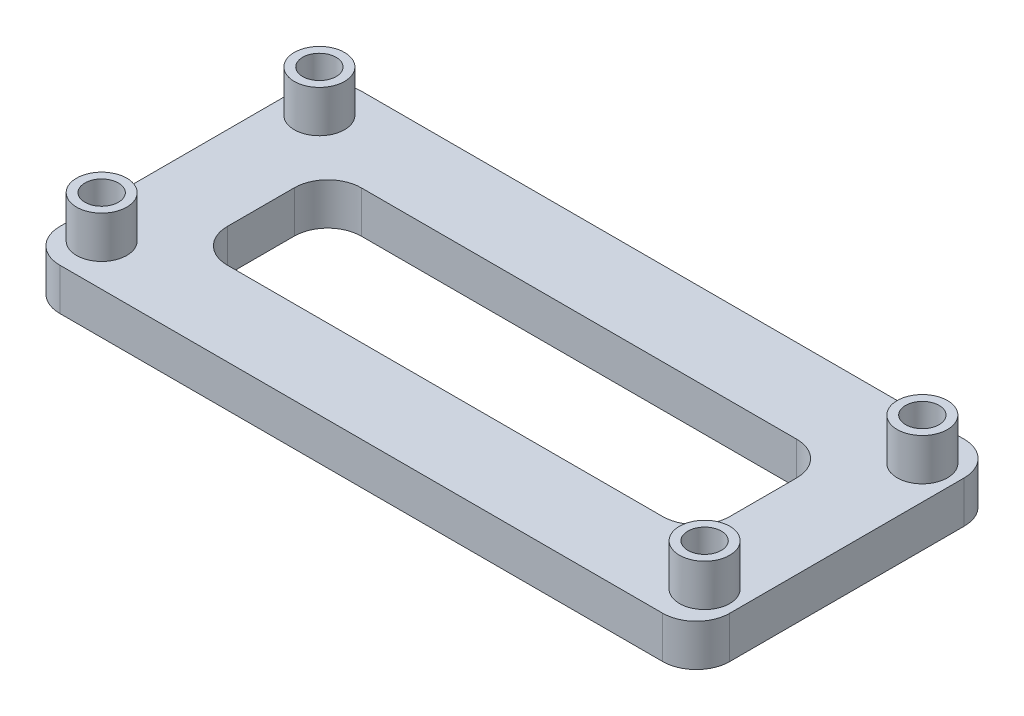
ISO-10303-21;
HEADER;
FILE_DESCRIPTION(('STEP AP214'),'2;1');
FILE_NAME('part.step','',(''),(''),'','','');
FILE_SCHEMA(('AUTOMOTIVE_DESIGN { 1 0 10303 214 1 1 1 1 }'));
ENDSEC;
DATA;
#1=APPLICATION_CONTEXT('core data for automotive mechanical design processes');
#2=APPLICATION_PROTOCOL_DEFINITION('international standard','automotive_design',2000,#1);
#3=PRODUCT_CONTEXT('',#1,'mechanical');
#4=PRODUCT('Part','Part','',(#3));
#5=PRODUCT_RELATED_PRODUCT_CATEGORY('part','',(#4));
#6=PRODUCT_DEFINITION_FORMATION('','',#4);
#7=PRODUCT_DEFINITION_CONTEXT('part definition',#1,'design');
#8=PRODUCT_DEFINITION('design','',#6,#7);
#9=PRODUCT_DEFINITION_SHAPE('','',#8);
#10=(LENGTH_UNIT() NAMED_UNIT(*) SI_UNIT(.MILLI.,.METRE.));
#11=(NAMED_UNIT(*) PLANE_ANGLE_UNIT() SI_UNIT($,.RADIAN.));
#12=(NAMED_UNIT(*) SI_UNIT($,.STERADIAN.) SOLID_ANGLE_UNIT());
#13=UNCERTAINTY_MEASURE_WITH_UNIT(LENGTH_MEASURE(1.E-05),#10,'distance_accuracy_value','');
#14=(GEOMETRIC_REPRESENTATION_CONTEXT(3) GLOBAL_UNCERTAINTY_ASSIGNED_CONTEXT((#13)) GLOBAL_UNIT_ASSIGNED_CONTEXT((#10,
#11,#12)) REPRESENTATION_CONTEXT('',''));
#15=CARTESIAN_POINT('',(0.,0.,0.));
#16=DIRECTION('',(0.,0.,1.));
#17=DIRECTION('',(1.,0.,0.));
#18=AXIS2_PLACEMENT_3D('',#15,#16,#17);
#19=CARTESIAN_POINT('',(0.,3.175,0.));
#20=DIRECTION('',(0.,-1.,0.));
#21=DIRECTION('',(0.,0.,-1.));
#22=AXIS2_PLACEMENT_3D('',#19,#20,#21);
#23=PLANE('',#22);
#24=CARTESIAN_POINT('',(48.26,3.175,-3.17499999999999));
#25=DIRECTION('',(0.,-1.,0.));
#26=DIRECTION('',(0.,0.,-1.));
#27=AXIS2_PLACEMENT_3D('',#24,#25,#26);
#28=CIRCLE('',#27,1.905);
#29=CARTESIAN_POINT('',(48.26,3.175,-5.07999999999999));
#30=VERTEX_POINT('',#29);
#31=EDGE_CURVE('E176',#30,#30,#28,.F.);
#32=ORIENTED_EDGE('',*,*,#31,.F.);
#33=EDGE_LOOP('',(#32));
#34=FACE_BOUND('',#33,.T.);
#35=CARTESIAN_POINT('',(2.54,3.175,-19.685));
#36=DIRECTION('',(0.,-1.,0.));
#37=DIRECTION('',(0.,0.,-1.));
#38=AXIS2_PLACEMENT_3D('',#35,#36,#37);
#39=CIRCLE('',#38,1.905);
#40=CARTESIAN_POINT('',(2.54,3.175,-21.59));
#41=VERTEX_POINT('',#40);
#42=EDGE_CURVE('E290',#41,#41,#39,.F.);
#43=ORIENTED_EDGE('',*,*,#42,.F.);
#44=EDGE_LOOP('',(#43));
#45=FACE_BOUND('',#44,.T.);
#46=DIRECTION('',(1.,0.,0.));
#47=VECTOR('',#46,1.);
#48=CARTESIAN_POINT('',(0.,3.175,0.));
#49=LINE('',#48,#47);
#50=CARTESIAN_POINT('',(2.54,3.175,0.));
#51=VERTEX_POINT('',#50);
#52=CARTESIAN_POINT('',(48.26,3.175,0.));
#53=VERTEX_POINT('',#52);
#54=EDGE_CURVE('E282',#51,#53,#49,.T.);
#55=ORIENTED_EDGE('',*,*,#54,.T.);
#56=CARTESIAN_POINT('',(48.26,3.175,-2.54));
#57=DIRECTION('',(0.,-1.,0.));
#58=DIRECTION('',(0.,0.,-1.));
#59=AXIS2_PLACEMENT_3D('',#56,#57,#58);
#60=CIRCLE('',#59,2.54);
#61=CARTESIAN_POINT('',(50.8,3.175,-2.54));
#62=VERTEX_POINT('',#61);
#63=EDGE_CURVE('E216',#53,#62,#60,.F.);
#64=ORIENTED_EDGE('',*,*,#63,.T.);
#65=DIRECTION('',(0.,0.,-1.));
#66=VECTOR('',#65,1.);
#67=CARTESIAN_POINT('',(50.8,3.175,0.));
#68=LINE('',#67,#66);
#69=CARTESIAN_POINT('',(50.8,3.175,-20.32));
#70=VERTEX_POINT('',#69);
#71=EDGE_CURVE('E286',#62,#70,#68,.T.);
#72=ORIENTED_EDGE('',*,*,#71,.T.);
#73=CARTESIAN_POINT('',(48.26,3.175,-20.32));
#74=DIRECTION('',(0.,-1.,0.));
#75=DIRECTION('',(0.,0.,-1.));
#76=AXIS2_PLACEMENT_3D('',#73,#74,#75);
#77=CIRCLE('',#76,2.54);
#78=CARTESIAN_POINT('',(48.26,3.175,-22.86));
#79=VERTEX_POINT('',#78);
#80=EDGE_CURVE('E55',#70,#79,#77,.F.);
#81=ORIENTED_EDGE('',*,*,#80,.T.);
#82=DIRECTION('',(-1.,0.,0.));
#83=VECTOR('',#82,1.);
#84=CARTESIAN_POINT('',(0.,3.175,-22.86));
#85=LINE('',#84,#83);
#86=CARTESIAN_POINT('',(2.54,3.175,-22.86));
#87=VERTEX_POINT('',#86);
#88=EDGE_CURVE('E288',#79,#87,#85,.T.);
#89=ORIENTED_EDGE('',*,*,#88,.T.);
#90=CARTESIAN_POINT('',(2.54,3.175,-20.32));
#91=DIRECTION('',(0.,-1.,0.));
#92=DIRECTION('',(0.,0.,-1.));
#93=AXIS2_PLACEMENT_3D('',#90,#91,#92);
#94=CIRCLE('',#93,2.54);
#95=CARTESIAN_POINT('',(0.,3.175,-20.32));
#96=VERTEX_POINT('',#95);
#97=EDGE_CURVE('E213',#87,#96,#94,.F.);
#98=ORIENTED_EDGE('',*,*,#97,.T.);
#99=DIRECTION('',(0.,0.,1.));
#100=VECTOR('',#99,1.);
#101=CARTESIAN_POINT('',(0.,3.175,0.));
#102=LINE('',#101,#100);
#103=CARTESIAN_POINT('',(0.,3.175,-2.54));
#104=VERTEX_POINT('',#103);
#105=EDGE_CURVE('E279',#96,#104,#102,.T.);
#106=ORIENTED_EDGE('',*,*,#105,.T.);
#107=CARTESIAN_POINT('',(2.54,3.175,-2.54));
#108=DIRECTION('',(0.,-1.,0.));
#109=DIRECTION('',(0.,0.,-1.));
#110=AXIS2_PLACEMENT_3D('',#107,#108,#109);
#111=CIRCLE('',#110,2.54);
#112=EDGE_CURVE('E211',#104,#51,#111,.F.);
#113=ORIENTED_EDGE('',*,*,#112,.T.);
#114=EDGE_LOOP('',(#55,#64,#72,#81,#89,#98,#106,#113));
#115=FACE_BOUND('',#114,.T.);
#116=DIRECTION('',(0.,0.,1.));
#117=VECTOR('',#116,1.);
#118=CARTESIAN_POINT('',(6.35,3.175,-16.51));
#119=LINE('',#118,#117);
#120=CARTESIAN_POINT('',(6.35,3.175,-13.97));
#121=VERTEX_POINT('',#120);
#122=CARTESIAN_POINT('',(6.35,3.175,-8.89));
#123=VERTEX_POINT('',#122);
#124=EDGE_CURVE('E260',#121,#123,#119,.T.);
#125=ORIENTED_EDGE('',*,*,#124,.F.);
#126=CARTESIAN_POINT('',(8.89,3.175,-13.97));
#127=DIRECTION('',(0.,-1.,0.));
#128=DIRECTION('',(0.,0.,-1.));
#129=AXIS2_PLACEMENT_3D('',#126,#127,#128);
#130=CIRCLE('',#129,2.54);
#131=CARTESIAN_POINT('',(8.89,3.175,-16.51));
#132=VERTEX_POINT('',#131);
#133=EDGE_CURVE('E11',#121,#132,#130,.T.);
#134=ORIENTED_EDGE('',*,*,#133,.T.);
#135=DIRECTION('',(-1.,0.,0.));
#136=VECTOR('',#135,1.);
#137=CARTESIAN_POINT('',(6.35,3.175,-16.51));
#138=LINE('',#137,#136);
#139=CARTESIAN_POINT('',(41.91,3.175,-16.51));
#140=VERTEX_POINT('',#139);
#141=EDGE_CURVE('E246',#140,#132,#138,.T.);
#142=ORIENTED_EDGE('',*,*,#141,.F.);
#143=CARTESIAN_POINT('',(41.91,3.175,-13.97));
#144=DIRECTION('',(0.,-1.,0.));
#145=DIRECTION('',(0.,0.,-1.));
#146=AXIS2_PLACEMENT_3D('',#143,#144,#145);
#147=CIRCLE('',#146,2.54);
#148=CARTESIAN_POINT('',(44.45,3.175,-13.97));
#149=VERTEX_POINT('',#148);
#150=EDGE_CURVE('E157',#140,#149,#147,.T.);
#151=ORIENTED_EDGE('',*,*,#150,.T.);
#152=DIRECTION('',(0.,0.,-1.));
#153=VECTOR('',#152,1.);
#154=CARTESIAN_POINT('',(44.45,3.175,-16.51));
#155=LINE('',#154,#153);
#156=CARTESIAN_POINT('',(44.45,3.175,-8.89));
#157=VERTEX_POINT('',#156);
#158=EDGE_CURVE('E243',#157,#149,#155,.T.);
#159=ORIENTED_EDGE('',*,*,#158,.F.);
#160=CARTESIAN_POINT('',(41.91,3.175,-8.89));
#161=DIRECTION('',(0.,-1.,0.));
#162=DIRECTION('',(0.,0.,-1.));
#163=AXIS2_PLACEMENT_3D('',#160,#161,#162);
#164=CIRCLE('',#163,2.54);
#165=CARTESIAN_POINT('',(41.91,3.175,-6.35));
#166=VERTEX_POINT('',#165);
#167=EDGE_CURVE('E233',#157,#166,#164,.T.);
#168=ORIENTED_EDGE('',*,*,#167,.T.);
#169=DIRECTION('',(1.,0.,0.));
#170=VECTOR('',#169,1.);
#171=CARTESIAN_POINT('',(6.35,3.175,-6.35));
#172=LINE('',#171,#170);
#173=CARTESIAN_POINT('',(8.89,3.175,-6.35));
#174=VERTEX_POINT('',#173);
#175=EDGE_CURVE('E254',#174,#166,#172,.T.);
#176=ORIENTED_EDGE('',*,*,#175,.F.);
#177=CARTESIAN_POINT('',(8.89,3.175,-8.89));
#178=DIRECTION('',(0.,-1.,0.));
#179=DIRECTION('',(0.,0.,-1.));
#180=AXIS2_PLACEMENT_3D('',#177,#178,#179);
#181=CIRCLE('',#180,2.54);
#182=EDGE_CURVE('E229',#174,#123,#181,.T.);
#183=ORIENTED_EDGE('',*,*,#182,.T.);
#184=EDGE_LOOP('',(#125,#134,#142,#151,#159,#168,#176,#183));
#185=FACE_BOUND('',#184,.T.);
#186=CARTESIAN_POINT('',(2.54,3.175,-3.175));
#187=DIRECTION('',(0.,-1.,0.));
#188=DIRECTION('',(0.,0.,-1.));
#189=AXIS2_PLACEMENT_3D('',#186,#187,#188);
#190=CIRCLE('',#189,1.905);
#191=CARTESIAN_POINT('',(2.54,3.175,-5.08));
#192=VERTEX_POINT('',#191);
#193=EDGE_CURVE('E302',#192,#192,#190,.F.);
#194=ORIENTED_EDGE('',*,*,#193,.F.);
#195=EDGE_LOOP('',(#194));
#196=FACE_BOUND('',#195,.T.);
#197=CARTESIAN_POINT('',(48.26,3.175,-19.685));
#198=DIRECTION('',(0.,-1.,0.));
#199=DIRECTION('',(0.,0.,-1.));
#200=AXIS2_PLACEMENT_3D('',#197,#198,#199);
#201=CIRCLE('',#200,1.905);
#202=CARTESIAN_POINT('',(48.26,3.175,-21.59));
#203=VERTEX_POINT('',#202);
#204=EDGE_CURVE('E171',#203,#203,#201,.F.);
#205=ORIENTED_EDGE('',*,*,#204,.F.);
#206=EDGE_LOOP('',(#205));
#207=FACE_BOUND('',#206,.T.);
#208=ADVANCED_FACE('F33',(#34,#45,#115,#185,#196,#207),#23,.F.);
#209=CARTESIAN_POINT('',(0.,0.,0.));
#210=DIRECTION('',(0.,-1.,0.));
#211=DIRECTION('',(0.,0.,-1.));
#212=AXIS2_PLACEMENT_3D('',#209,#210,#211);
#213=PLANE('',#212);
#214=CARTESIAN_POINT('',(48.26,0.,-3.175));
#215=DIRECTION('',(0.,1.,0.));
#216=DIRECTION('',(0.,0.,1.));
#217=AXIS2_PLACEMENT_3D('',#214,#215,#216);
#218=CIRCLE('',#217,1.27);
#219=CARTESIAN_POINT('',(48.26,0.,-1.905));
#220=VERTEX_POINT('',#219);
#221=EDGE_CURVE('E266',#220,#220,#218,.T.);
#222=ORIENTED_EDGE('',*,*,#221,.T.);
#223=EDGE_LOOP('',(#222));
#224=FACE_BOUND('',#223,.T.);
#225=CARTESIAN_POINT('',(48.26,0.,-19.685));
#226=DIRECTION('',(0.,1.,0.));
#227=DIRECTION('',(0.,0.,1.));
#228=AXIS2_PLACEMENT_3D('',#225,#226,#227);
#229=CIRCLE('',#228,1.27);
#230=CARTESIAN_POINT('',(48.26,0.,-18.415));
#231=VERTEX_POINT('',#230);
#232=EDGE_CURVE('E272',#231,#231,#229,.T.);
#233=ORIENTED_EDGE('',*,*,#232,.T.);
#234=EDGE_LOOP('',(#233));
#235=FACE_BOUND('',#234,.T.);
#236=DIRECTION('',(0.,0.,-1.));
#237=VECTOR('',#236,1.);
#238=CARTESIAN_POINT('',(50.8,0.,0.));
#239=LINE('',#238,#237);
#240=CARTESIAN_POINT('',(50.8,0.,-2.54));
#241=VERTEX_POINT('',#240);
#242=CARTESIAN_POINT('',(50.8,0.,-20.32));
#243=VERTEX_POINT('',#242);
#244=EDGE_CURVE('E296',#241,#243,#239,.T.);
#245=ORIENTED_EDGE('',*,*,#244,.F.);
#246=CARTESIAN_POINT('',(48.26,0.,-2.54));
#247=DIRECTION('',(0.,-1.,0.));
#248=DIRECTION('',(0.,0.,-1.));
#249=AXIS2_PLACEMENT_3D('',#246,#247,#248);
#250=CIRCLE('',#249,2.54);
#251=CARTESIAN_POINT('',(48.26,0.,0.));
#252=VERTEX_POINT('',#251);
#253=EDGE_CURVE('E204',#241,#252,#250,.T.);
#254=ORIENTED_EDGE('',*,*,#253,.T.);
#255=DIRECTION('',(1.,0.,0.));
#256=VECTOR('',#255,1.);
#257=CARTESIAN_POINT('',(0.,0.,0.));
#258=LINE('',#257,#256);
#259=CARTESIAN_POINT('',(2.54,0.,0.));
#260=VERTEX_POINT('',#259);
#261=EDGE_CURVE('E293',#260,#252,#258,.T.);
#262=ORIENTED_EDGE('',*,*,#261,.F.);
#263=CARTESIAN_POINT('',(2.54,0.,-2.54));
#264=DIRECTION('',(0.,-1.,0.));
#265=DIRECTION('',(0.,0.,-1.));
#266=AXIS2_PLACEMENT_3D('',#263,#264,#265);
#267=CIRCLE('',#266,2.54);
#268=CARTESIAN_POINT('',(0.,0.,-2.54));
#269=VERTEX_POINT('',#268);
#270=EDGE_CURVE('E198',#260,#269,#267,.T.);
#271=ORIENTED_EDGE('',*,*,#270,.T.);
#272=DIRECTION('',(0.,0.,1.));
#273=VECTOR('',#272,1.);
#274=CARTESIAN_POINT('',(0.,0.,0.));
#275=LINE('',#274,#273);
#276=CARTESIAN_POINT('',(0.,0.,-20.32));
#277=VERTEX_POINT('',#276);
#278=EDGE_CURVE('E278',#277,#269,#275,.T.);
#279=ORIENTED_EDGE('',*,*,#278,.F.);
#280=CARTESIAN_POINT('',(2.54,0.,-20.32));
#281=DIRECTION('',(0.,-1.,0.));
#282=DIRECTION('',(0.,0.,-1.));
#283=AXIS2_PLACEMENT_3D('',#280,#281,#282);
#284=CIRCLE('',#283,2.54);
#285=CARTESIAN_POINT('',(2.54,0.,-22.86));
#286=VERTEX_POINT('',#285);
#287=EDGE_CURVE('E200',#277,#286,#284,.T.);
#288=ORIENTED_EDGE('',*,*,#287,.T.);
#289=DIRECTION('',(-1.,0.,0.));
#290=VECTOR('',#289,1.);
#291=CARTESIAN_POINT('',(0.,0.,-22.86));
#292=LINE('',#291,#290);
#293=CARTESIAN_POINT('',(48.26,0.,-22.86));
#294=VERTEX_POINT('',#293);
#295=EDGE_CURVE('E283',#294,#286,#292,.T.);
#296=ORIENTED_EDGE('',*,*,#295,.F.);
#297=CARTESIAN_POINT('',(48.26,0.,-20.32));
#298=DIRECTION('',(0.,-1.,0.));
#299=DIRECTION('',(0.,0.,-1.));
#300=AXIS2_PLACEMENT_3D('',#297,#298,#299);
#301=CIRCLE('',#300,2.54);
#302=EDGE_CURVE('E202',#294,#243,#301,.T.);
#303=ORIENTED_EDGE('',*,*,#302,.T.);
#304=EDGE_LOOP('',(#245,#254,#262,#271,#279,#288,#296,#303));
#305=FACE_BOUND('',#304,.T.);
#306=CARTESIAN_POINT('',(2.54,0.,-19.685));
#307=DIRECTION('',(0.,1.,0.));
#308=DIRECTION('',(0.,0.,1.));
#309=AXIS2_PLACEMENT_3D('',#306,#307,#308);
#310=CIRCLE('',#309,1.27);
#311=CARTESIAN_POINT('',(2.54,0.,-18.415));
#312=VERTEX_POINT('',#311);
#313=EDGE_CURVE('E275',#312,#312,#310,.T.);
#314=ORIENTED_EDGE('',*,*,#313,.T.);
#315=EDGE_LOOP('',(#314));
#316=FACE_BOUND('',#315,.T.);
#317=CARTESIAN_POINT('',(2.54,0.,-3.175));
#318=DIRECTION('',(0.,1.,0.));
#319=DIRECTION('',(0.,0.,1.));
#320=AXIS2_PLACEMENT_3D('',#317,#318,#319);
#321=CIRCLE('',#320,1.27);
#322=CARTESIAN_POINT('',(2.54,0.,-1.905));
#323=VERTEX_POINT('',#322);
#324=EDGE_CURVE('E269',#323,#323,#321,.T.);
#325=ORIENTED_EDGE('',*,*,#324,.T.);
#326=EDGE_LOOP('',(#325));
#327=FACE_BOUND('',#326,.T.);
#328=DIRECTION('',(0.,0.,-1.));
#329=VECTOR('',#328,1.);
#330=CARTESIAN_POINT('',(44.45,0.,-16.51));
#331=LINE('',#330,#329);
#332=CARTESIAN_POINT('',(44.45,0.,-8.89));
#333=VERTEX_POINT('',#332);
#334=CARTESIAN_POINT('',(44.45,0.,-13.97));
#335=VERTEX_POINT('',#334);
#336=EDGE_CURVE('E257',#333,#335,#331,.T.);
#337=ORIENTED_EDGE('',*,*,#336,.T.);
#338=CARTESIAN_POINT('',(41.91,0.,-13.97));
#339=DIRECTION('',(0.,-1.,0.));
#340=DIRECTION('',(0.,0.,-1.));
#341=AXIS2_PLACEMENT_3D('',#338,#339,#340);
#342=CIRCLE('',#341,2.54);
#343=CARTESIAN_POINT('',(41.91,0.,-16.51));
#344=VERTEX_POINT('',#343);
#345=EDGE_CURVE('E235',#335,#344,#342,.F.);
#346=ORIENTED_EDGE('',*,*,#345,.T.);
#347=DIRECTION('',(-1.,0.,0.));
#348=VECTOR('',#347,1.);
#349=CARTESIAN_POINT('',(6.35,0.,-16.51));
#350=LINE('',#349,#348);
#351=CARTESIAN_POINT('',(8.89,0.,-16.51));
#352=VERTEX_POINT('',#351);
#353=EDGE_CURVE('E152',#344,#352,#350,.T.);
#354=ORIENTED_EDGE('',*,*,#353,.T.);
#355=CARTESIAN_POINT('',(8.89,0.,-13.97));
#356=DIRECTION('',(0.,-1.,0.));
#357=DIRECTION('',(0.,0.,-1.));
#358=AXIS2_PLACEMENT_3D('',#355,#356,#357);
#359=CIRCLE('',#358,2.54);
#360=CARTESIAN_POINT('',(6.35,0.,-13.97));
#361=VERTEX_POINT('',#360);
#362=EDGE_CURVE('E41',#352,#361,#359,.F.);
#363=ORIENTED_EDGE('',*,*,#362,.T.);
#364=DIRECTION('',(0.,0.,1.));
#365=VECTOR('',#364,1.);
#366=CARTESIAN_POINT('',(6.35,0.,-16.51));
#367=LINE('',#366,#365);
#368=CARTESIAN_POINT('',(6.35,0.,-8.89));
#369=VERTEX_POINT('',#368);
#370=EDGE_CURVE('E150',#361,#369,#367,.T.);
#371=ORIENTED_EDGE('',*,*,#370,.T.);
#372=CARTESIAN_POINT('',(8.89,0.,-8.89));
#373=DIRECTION('',(0.,-1.,0.));
#374=DIRECTION('',(0.,0.,-1.));
#375=AXIS2_PLACEMENT_3D('',#372,#373,#374);
#376=CIRCLE('',#375,2.54);
#377=CARTESIAN_POINT('',(8.89,0.,-6.35));
#378=VERTEX_POINT('',#377);
#379=EDGE_CURVE('E227',#369,#378,#376,.F.);
#380=ORIENTED_EDGE('',*,*,#379,.T.);
#381=DIRECTION('',(1.,0.,0.));
#382=VECTOR('',#381,1.);
#383=CARTESIAN_POINT('',(6.35,0.,-6.35));
#384=LINE('',#383,#382);
#385=CARTESIAN_POINT('',(41.91,0.,-6.35));
#386=VERTEX_POINT('',#385);
#387=EDGE_CURVE('E166',#378,#386,#384,.T.);
#388=ORIENTED_EDGE('',*,*,#387,.T.);
#389=CARTESIAN_POINT('',(41.91,0.,-8.89));
#390=DIRECTION('',(0.,-1.,0.));
#391=DIRECTION('',(0.,0.,-1.));
#392=AXIS2_PLACEMENT_3D('',#389,#390,#391);
#393=CIRCLE('',#392,2.54);
#394=EDGE_CURVE('E231',#386,#333,#393,.F.);
#395=ORIENTED_EDGE('',*,*,#394,.T.);
#396=EDGE_LOOP('',(#337,#346,#354,#363,#371,#380,#388,#395));
#397=FACE_BOUND('',#396,.T.);
#398=ADVANCED_FACE('F149',(#224,#235,#305,#316,#327,#397),#213,.T.);
#399=CARTESIAN_POINT('',(0.,3.175,0.));
#400=DIRECTION('',(1.,0.,0.));
#401=DIRECTION('',(0.,0.,-1.));
#402=AXIS2_PLACEMENT_3D('',#399,#400,#401);
#403=PLANE('',#402);
#404=ORIENTED_EDGE('',*,*,#105,.F.);
#405=DIRECTION('',(0.,-1.,0.));
#406=VECTOR('',#405,1.);
#407=CARTESIAN_POINT('',(0.,3.175,-20.32));
#408=LINE('',#407,#406);
#409=EDGE_CURVE('E224',#96,#277,#408,.T.);
#410=ORIENTED_EDGE('',*,*,#409,.T.);
#411=ORIENTED_EDGE('',*,*,#278,.T.);
#412=DIRECTION('',(0.,-1.,0.));
#413=VECTOR('',#412,1.);
#414=CARTESIAN_POINT('',(0.,3.175,-2.54));
#415=LINE('',#414,#413);
#416=EDGE_CURVE('E222',#269,#104,#415,.F.);
#417=ORIENTED_EDGE('',*,*,#416,.T.);
#418=EDGE_LOOP('',(#404,#410,#411,#417));
#419=FACE_BOUND('',#418,.T.);
#420=ADVANCED_FACE('F342',(#419),#403,.F.);
#421=CARTESIAN_POINT('',(0.,3.175,0.));
#422=DIRECTION('',(0.,0.,-1.));
#423=DIRECTION('',(-1.,0.,0.));
#424=AXIS2_PLACEMENT_3D('',#421,#422,#423);
#425=PLANE('',#424);
#426=ORIENTED_EDGE('',*,*,#261,.T.);
#427=DIRECTION('',(0.,-1.,0.));
#428=VECTOR('',#427,1.);
#429=CARTESIAN_POINT('',(48.26,3.175,0.));
#430=LINE('',#429,#428);
#431=EDGE_CURVE('E209',#252,#53,#430,.F.);
#432=ORIENTED_EDGE('',*,*,#431,.T.);
#433=ORIENTED_EDGE('',*,*,#54,.F.);
#434=DIRECTION('',(0.,-1.,0.));
#435=VECTOR('',#434,1.);
#436=CARTESIAN_POINT('',(2.54,3.175,0.));
#437=LINE('',#436,#435);
#438=EDGE_CURVE('E206',#51,#260,#437,.T.);
#439=ORIENTED_EDGE('',*,*,#438,.T.);
#440=EDGE_LOOP('',(#426,#432,#433,#439));
#441=FACE_BOUND('',#440,.T.);
#442=ADVANCED_FACE('F345',(#441),#425,.F.);
#443=CARTESIAN_POINT('',(50.8,3.175,0.));
#444=DIRECTION('',(-1.,0.,0.));
#445=DIRECTION('',(0.,0.,1.));
#446=AXIS2_PLACEMENT_3D('',#443,#444,#445);
#447=PLANE('',#446);
#448=ORIENTED_EDGE('',*,*,#71,.F.);
#449=DIRECTION('',(0.,-1.,0.));
#450=VECTOR('',#449,1.);
#451=CARTESIAN_POINT('',(50.8,3.175,-2.54));
#452=LINE('',#451,#450);
#453=EDGE_CURVE('E195',#62,#241,#452,.T.);
#454=ORIENTED_EDGE('',*,*,#453,.T.);
#455=ORIENTED_EDGE('',*,*,#244,.T.);
#456=DIRECTION('',(0.,-1.,0.));
#457=VECTOR('',#456,1.);
#458=CARTESIAN_POINT('',(50.8,3.175,-20.32));
#459=LINE('',#458,#457);
#460=EDGE_CURVE('E193',#243,#70,#459,.F.);
#461=ORIENTED_EDGE('',*,*,#460,.T.);
#462=EDGE_LOOP('',(#448,#454,#455,#461));
#463=FACE_BOUND('',#462,.T.);
#464=ADVANCED_FACE('F325',(#463),#447,.F.);
#465=CARTESIAN_POINT('',(0.,3.175,-22.86));
#466=DIRECTION('',(0.,0.,1.));
#467=DIRECTION('',(1.,0.,0.));
#468=AXIS2_PLACEMENT_3D('',#465,#466,#467);
#469=PLANE('',#468);
#470=ORIENTED_EDGE('',*,*,#88,.F.);
#471=DIRECTION('',(0.,-1.,0.));
#472=VECTOR('',#471,1.);
#473=CARTESIAN_POINT('',(48.26,3.175,-22.86));
#474=LINE('',#473,#472);
#475=EDGE_CURVE('E219',#79,#294,#474,.T.);
#476=ORIENTED_EDGE('',*,*,#475,.T.);
#477=ORIENTED_EDGE('',*,*,#295,.T.);
#478=DIRECTION('',(0.,-1.,0.));
#479=VECTOR('',#478,1.);
#480=CARTESIAN_POINT('',(2.54,3.175,-22.86));
#481=LINE('',#480,#479);
#482=EDGE_CURVE('E48',#286,#87,#481,.F.);
#483=ORIENTED_EDGE('',*,*,#482,.T.);
#484=EDGE_LOOP('',(#470,#476,#477,#483));
#485=FACE_BOUND('',#484,.T.);
#486=ADVANCED_FACE('F334',(#485),#469,.F.);
#487=CARTESIAN_POINT('',(2.54,3.175,-19.685));
#488=DIRECTION('',(0.,-1.,0.));
#489=DIRECTION('',(0.,0.,-1.));
#490=AXIS2_PLACEMENT_3D('',#487,#488,#489);
#491=CYLINDRICAL_SURFACE('',#490,1.27);
#492=ORIENTED_EDGE('',*,*,#313,.F.);
#493=EDGE_LOOP('',(#492));
#494=FACE_BOUND('',#493,.T.);
#495=CARTESIAN_POINT('',(2.54,6.35,-19.685));
#496=DIRECTION('',(0.,1.,0.));
#497=DIRECTION('',(0.,0.,1.));
#498=AXIS2_PLACEMENT_3D('',#495,#496,#497);
#499=CIRCLE('',#498,1.27);
#500=CARTESIAN_POINT('',(2.54,6.35,-18.415));
#501=VERTEX_POINT('',#500);
#502=EDGE_CURVE('E628',#501,#501,#499,.T.);
#503=ORIENTED_EDGE('',*,*,#502,.T.);
#504=EDGE_LOOP('',(#503));
#505=FACE_BOUND('',#504,.T.);
#506=ADVANCED_FACE('F469',(#494,#505),#491,.F.);
#507=CARTESIAN_POINT('',(48.26,3.175,-19.685));
#508=DIRECTION('',(0.,-1.,0.));
#509=DIRECTION('',(0.,0.,-1.));
#510=AXIS2_PLACEMENT_3D('',#507,#508,#509);
#511=CYLINDRICAL_SURFACE('',#510,1.27);
#512=ORIENTED_EDGE('',*,*,#232,.F.);
#513=EDGE_LOOP('',(#512));
#514=FACE_BOUND('',#513,.T.);
#515=CARTESIAN_POINT('',(48.26,6.35,-19.685));
#516=DIRECTION('',(0.,1.,0.));
#517=DIRECTION('',(0.,0.,-1.));
#518=AXIS2_PLACEMENT_3D('',#515,#516,#517);
#519=CIRCLE('',#518,1.27);
#520=CARTESIAN_POINT('',(48.26,6.35,-20.955));
#521=VERTEX_POINT('',#520);
#522=EDGE_CURVE('E658',#521,#521,#519,.T.);
#523=ORIENTED_EDGE('',*,*,#522,.T.);
#524=EDGE_LOOP('',(#523));
#525=FACE_BOUND('',#524,.T.);
#526=ADVANCED_FACE('F593',(#514,#525),#511,.F.);
#527=CARTESIAN_POINT('',(2.54,3.175,-3.175));
#528=DIRECTION('',(0.,-1.,0.));
#529=DIRECTION('',(0.,0.,-1.));
#530=AXIS2_PLACEMENT_3D('',#527,#528,#529);
#531=CYLINDRICAL_SURFACE('',#530,1.27);
#532=ORIENTED_EDGE('',*,*,#324,.F.);
#533=EDGE_LOOP('',(#532));
#534=FACE_BOUND('',#533,.T.);
#535=CARTESIAN_POINT('',(2.54,6.35,-3.175));
#536=DIRECTION('',(0.,1.,0.));
#537=DIRECTION('',(0.,0.,-1.));
#538=AXIS2_PLACEMENT_3D('',#535,#536,#537);
#539=CIRCLE('',#538,1.27);
#540=CARTESIAN_POINT('',(2.54,6.35,-4.445));
#541=VERTEX_POINT('',#540);
#542=EDGE_CURVE('E635',#541,#541,#539,.T.);
#543=ORIENTED_EDGE('',*,*,#542,.T.);
#544=EDGE_LOOP('',(#543));
#545=FACE_BOUND('',#544,.T.);
#546=ADVANCED_FACE('F583',(#534,#545),#531,.F.);
#547=CARTESIAN_POINT('',(48.26,3.175,-3.175));
#548=DIRECTION('',(0.,-1.,0.));
#549=DIRECTION('',(0.,0.,-1.));
#550=AXIS2_PLACEMENT_3D('',#547,#548,#549);
#551=CYLINDRICAL_SURFACE('',#550,1.27);
#552=ORIENTED_EDGE('',*,*,#221,.F.);
#553=EDGE_LOOP('',(#552));
#554=FACE_BOUND('',#553,.T.);
#555=CARTESIAN_POINT('',(48.26,6.35,-3.17499999999999));
#556=DIRECTION('',(0.,1.,0.));
#557=DIRECTION('',(0.,0.,1.));
#558=AXIS2_PLACEMENT_3D('',#555,#556,#557);
#559=CIRCLE('',#558,1.27);
#560=CARTESIAN_POINT('',(48.26,6.35,-1.90499999999999));
#561=VERTEX_POINT('',#560);
#562=EDGE_CURVE('E652',#561,#561,#559,.T.);
#563=ORIENTED_EDGE('',*,*,#562,.T.);
#564=EDGE_LOOP('',(#563));
#565=FACE_BOUND('',#564,.T.);
#566=ADVANCED_FACE('F458',(#554,#565),#551,.F.);
#567=CARTESIAN_POINT('',(6.35,3.175,-16.51));
#568=DIRECTION('',(1.,0.,0.));
#569=DIRECTION('',(0.,0.,-1.));
#570=AXIS2_PLACEMENT_3D('',#567,#568,#569);
#571=PLANE('',#570);
#572=ORIENTED_EDGE('',*,*,#124,.T.);
#573=DIRECTION('',(0.,-1.,0.));
#574=VECTOR('',#573,1.);
#575=CARTESIAN_POINT('',(6.35,0.,-8.89));
#576=LINE('',#575,#574);
#577=EDGE_CURVE('E165',#123,#369,#576,.T.);
#578=ORIENTED_EDGE('',*,*,#577,.T.);
#579=ORIENTED_EDGE('',*,*,#370,.F.);
#580=DIRECTION('',(0.,-1.,0.));
#581=VECTOR('',#580,1.);
#582=CARTESIAN_POINT('',(6.35,3.175,-13.97));
#583=LINE('',#582,#581);
#584=EDGE_CURVE('E162',#361,#121,#583,.F.);
#585=ORIENTED_EDGE('',*,*,#584,.T.);
#586=EDGE_LOOP('',(#572,#578,#579,#585));
#587=FACE_BOUND('',#586,.T.);
#588=ADVANCED_FACE('F161',(#587),#571,.T.);
#589=CARTESIAN_POINT('',(6.35,3.175,-6.35));
#590=DIRECTION('',(0.,0.,-1.));
#591=DIRECTION('',(-1.,0.,0.));
#592=AXIS2_PLACEMENT_3D('',#589,#590,#591);
#593=PLANE('',#592);
#594=ORIENTED_EDGE('',*,*,#387,.F.);
#595=DIRECTION('',(0.,-1.,0.));
#596=VECTOR('',#595,1.);
#597=CARTESIAN_POINT('',(8.89,3.175,-6.35));
#598=LINE('',#597,#596);
#599=EDGE_CURVE('E182',#378,#174,#598,.F.);
#600=ORIENTED_EDGE('',*,*,#599,.T.);
#601=ORIENTED_EDGE('',*,*,#175,.T.);
#602=DIRECTION('',(0.,-1.,0.));
#603=VECTOR('',#602,1.);
#604=CARTESIAN_POINT('',(41.91,0.,-6.35));
#605=LINE('',#604,#603);
#606=EDGE_CURVE('E173',#166,#386,#605,.T.);
#607=ORIENTED_EDGE('',*,*,#606,.T.);
#608=EDGE_LOOP('',(#594,#600,#601,#607));
#609=FACE_BOUND('',#608,.T.);
#610=ADVANCED_FACE('F440',(#609),#593,.T.);
#611=CARTESIAN_POINT('',(44.45,3.175,-16.51));
#612=DIRECTION('',(-1.,0.,0.));
#613=DIRECTION('',(0.,0.,1.));
#614=AXIS2_PLACEMENT_3D('',#611,#612,#613);
#615=PLANE('',#614);
#616=ORIENTED_EDGE('',*,*,#336,.F.);
#617=DIRECTION('',(0.,-1.,0.));
#618=VECTOR('',#617,1.);
#619=CARTESIAN_POINT('',(44.45,3.175,-8.89));
#620=LINE('',#619,#618);
#621=EDGE_CURVE('E187',#333,#157,#620,.F.);
#622=ORIENTED_EDGE('',*,*,#621,.T.);
#623=ORIENTED_EDGE('',*,*,#158,.T.);
#624=DIRECTION('',(0.,-1.,0.));
#625=VECTOR('',#624,1.);
#626=CARTESIAN_POINT('',(44.45,0.,-13.97));
#627=LINE('',#626,#625);
#628=EDGE_CURVE('E184',#149,#335,#627,.T.);
#629=ORIENTED_EDGE('',*,*,#628,.T.);
#630=EDGE_LOOP('',(#616,#622,#623,#629));
#631=FACE_BOUND('',#630,.T.);
#632=ADVANCED_FACE('F252',(#631),#615,.T.);
#633=CARTESIAN_POINT('',(6.35,3.175,-16.51));
#634=DIRECTION('',(0.,0.,1.));
#635=DIRECTION('',(1.,0.,0.));
#636=AXIS2_PLACEMENT_3D('',#633,#634,#635);
#637=PLANE('',#636);
#638=ORIENTED_EDGE('',*,*,#353,.F.);
#639=DIRECTION('',(0.,-1.,0.));
#640=VECTOR('',#639,1.);
#641=CARTESIAN_POINT('',(41.91,3.175,-16.51));
#642=LINE('',#641,#640);
#643=EDGE_CURVE('E191',#344,#140,#642,.F.);
#644=ORIENTED_EDGE('',*,*,#643,.T.);
#645=ORIENTED_EDGE('',*,*,#141,.T.);
#646=DIRECTION('',(0.,-1.,0.));
#647=VECTOR('',#646,1.);
#648=CARTESIAN_POINT('',(8.89,0.,-16.51));
#649=LINE('',#648,#647);
#650=EDGE_CURVE('E189',#132,#352,#649,.T.);
#651=ORIENTED_EDGE('',*,*,#650,.T.);
#652=EDGE_LOOP('',(#638,#644,#645,#651));
#653=FACE_BOUND('',#652,.T.);
#654=ADVANCED_FACE('F259',(#653),#637,.T.);
#655=CARTESIAN_POINT('',(2.54,6.35,-19.685));
#656=DIRECTION('',(0.,1.,0.));
#657=DIRECTION('',(0.,0.,1.));
#658=AXIS2_PLACEMENT_3D('',#655,#656,#657);
#659=PLANE('',#658);
#660=CARTESIAN_POINT('',(2.54,6.35,-19.685));
#661=DIRECTION('',(0.,1.,0.));
#662=DIRECTION('',(0.,0.,1.));
#663=AXIS2_PLACEMENT_3D('',#660,#661,#662);
#664=CIRCLE('',#663,1.905);
#665=CARTESIAN_POINT('',(2.54,6.35,-17.78));
#666=VERTEX_POINT('',#665);
#667=EDGE_CURVE('E167',#666,#666,#664,.T.);
#668=ORIENTED_EDGE('',*,*,#667,.T.);
#669=EDGE_LOOP('',(#668));
#670=FACE_BOUND('',#669,.T.);
#671=ORIENTED_EDGE('',*,*,#502,.F.);
#672=EDGE_LOOP('',(#671));
#673=FACE_BOUND('',#672,.T.);
#674=ADVANCED_FACE('F429',(#670,#673),#659,.T.);
#675=CARTESIAN_POINT('',(2.54,6.35,-19.685));
#676=DIRECTION('',(0.,-1.,0.));
#677=DIRECTION('',(0.,0.,-1.));
#678=AXIS2_PLACEMENT_3D('',#675,#676,#677);
#679=CYLINDRICAL_SURFACE('',#678,1.905);
#680=ORIENTED_EDGE('',*,*,#667,.F.);
#681=EDGE_LOOP('',(#680));
#682=FACE_BOUND('',#681,.T.);
#683=ORIENTED_EDGE('',*,*,#42,.T.);
#684=EDGE_LOOP('',(#683));
#685=FACE_BOUND('',#684,.T.);
#686=ADVANCED_FACE('F557',(#682,#685),#679,.T.);
#687=CARTESIAN_POINT('',(2.54,6.35,-3.175));
#688=DIRECTION('',(0.,-1.,0.));
#689=DIRECTION('',(0.,0.,-1.));
#690=AXIS2_PLACEMENT_3D('',#687,#688,#689);
#691=PLANE('',#690);
#692=CARTESIAN_POINT('',(2.54,6.35,-3.175));
#693=DIRECTION('',(0.,1.,0.));
#694=DIRECTION('',(0.,0.,-1.));
#695=AXIS2_PLACEMENT_3D('',#692,#693,#694);
#696=CIRCLE('',#695,1.905);
#697=CARTESIAN_POINT('',(2.54,6.35,-5.08));
#698=VERTEX_POINT('',#697);
#699=EDGE_CURVE('E630',#698,#698,#696,.T.);
#700=ORIENTED_EDGE('',*,*,#699,.T.);
#701=EDGE_LOOP('',(#700));
#702=FACE_BOUND('',#701,.T.);
#703=ORIENTED_EDGE('',*,*,#542,.F.);
#704=EDGE_LOOP('',(#703));
#705=FACE_BOUND('',#704,.T.);
#706=ADVANCED_FACE('F547',(#702,#705),#691,.F.);
#707=CARTESIAN_POINT('',(2.54,6.35,-3.175));
#708=DIRECTION('',(0.,-1.,0.));
#709=DIRECTION('',(0.,0.,-1.));
#710=AXIS2_PLACEMENT_3D('',#707,#708,#709);
#711=CYLINDRICAL_SURFACE('',#710,1.905);
#712=ORIENTED_EDGE('',*,*,#699,.F.);
#713=EDGE_LOOP('',(#712));
#714=FACE_BOUND('',#713,.T.);
#715=ORIENTED_EDGE('',*,*,#193,.T.);
#716=EDGE_LOOP('',(#715));
#717=FACE_BOUND('',#716,.T.);
#718=ADVANCED_FACE('F537',(#714,#717),#711,.T.);
#719=CARTESIAN_POINT('',(48.26,6.35,-3.17499999999999));
#720=DIRECTION('',(0.,1.,0.));
#721=DIRECTION('',(0.,0.,1.));
#722=AXIS2_PLACEMENT_3D('',#719,#720,#721);
#723=PLANE('',#722);
#724=CARTESIAN_POINT('',(48.26,6.35,-3.17499999999999));
#725=DIRECTION('',(0.,1.,0.));
#726=DIRECTION('',(0.,0.,1.));
#727=AXIS2_PLACEMENT_3D('',#724,#725,#726);
#728=CIRCLE('',#727,1.905);
#729=CARTESIAN_POINT('',(48.26,6.35,-1.26999999999999));
#730=VERTEX_POINT('',#729);
#731=EDGE_CURVE('E649',#730,#730,#728,.T.);
#732=ORIENTED_EDGE('',*,*,#731,.T.);
#733=EDGE_LOOP('',(#732));
#734=FACE_BOUND('',#733,.T.);
#735=ORIENTED_EDGE('',*,*,#562,.F.);
#736=EDGE_LOOP('',(#735));
#737=FACE_BOUND('',#736,.T.);
#738=ADVANCED_FACE('F527',(#734,#737),#723,.T.);
#739=CARTESIAN_POINT('',(48.26,6.35,-3.17499999999999));
#740=DIRECTION('',(0.,-1.,0.));
#741=DIRECTION('',(0.,0.,-1.));
#742=AXIS2_PLACEMENT_3D('',#739,#740,#741);
#743=CYLINDRICAL_SURFACE('',#742,1.905);
#744=ORIENTED_EDGE('',*,*,#731,.F.);
#745=EDGE_LOOP('',(#744));
#746=FACE_BOUND('',#745,.T.);
#747=ORIENTED_EDGE('',*,*,#31,.T.);
#748=EDGE_LOOP('',(#747));
#749=FACE_BOUND('',#748,.T.);
#750=ADVANCED_FACE('F307',(#746,#749),#743,.T.);
#751=CARTESIAN_POINT('',(48.26,6.35,-19.685));
#752=DIRECTION('',(0.,-1.,0.));
#753=DIRECTION('',(0.,0.,-1.));
#754=AXIS2_PLACEMENT_3D('',#751,#752,#753);
#755=PLANE('',#754);
#756=CARTESIAN_POINT('',(48.26,6.35,-19.685));
#757=DIRECTION('',(0.,1.,0.));
#758=DIRECTION('',(0.,0.,-1.));
#759=AXIS2_PLACEMENT_3D('',#756,#757,#758);
#760=CIRCLE('',#759,1.905);
#761=CARTESIAN_POINT('',(48.26,6.35,-21.59));
#762=VERTEX_POINT('',#761);
#763=EDGE_CURVE('E655',#762,#762,#760,.T.);
#764=ORIENTED_EDGE('',*,*,#763,.T.);
#765=EDGE_LOOP('',(#764));
#766=FACE_BOUND('',#765,.T.);
#767=ORIENTED_EDGE('',*,*,#522,.F.);
#768=EDGE_LOOP('',(#767));
#769=FACE_BOUND('',#768,.T.);
#770=ADVANCED_FACE('F508',(#766,#769),#755,.F.);
#771=CARTESIAN_POINT('',(48.26,6.35,-19.685));
#772=DIRECTION('',(0.,-1.,0.));
#773=DIRECTION('',(0.,0.,-1.));
#774=AXIS2_PLACEMENT_3D('',#771,#772,#773);
#775=CYLINDRICAL_SURFACE('',#774,1.905);
#776=ORIENTED_EDGE('',*,*,#763,.F.);
#777=EDGE_LOOP('',(#776));
#778=FACE_BOUND('',#777,.T.);
#779=ORIENTED_EDGE('',*,*,#204,.T.);
#780=EDGE_LOOP('',(#779));
#781=FACE_BOUND('',#780,.T.);
#782=ADVANCED_FACE('F360',(#778,#781),#775,.T.);
#783=CARTESIAN_POINT('',(8.89,3.175,-8.89));
#784=DIRECTION('',(0.,1.,0.));
#785=DIRECTION('',(0.,0.,1.));
#786=AXIS2_PLACEMENT_3D('',#783,#784,#785);
#787=CYLINDRICAL_SURFACE('',#786,2.54);
#788=ORIENTED_EDGE('',*,*,#182,.F.);
#789=ORIENTED_EDGE('',*,*,#599,.F.);
#790=ORIENTED_EDGE('',*,*,#379,.F.);
#791=ORIENTED_EDGE('',*,*,#577,.F.);
#792=EDGE_LOOP('',(#788,#789,#790,#791));
#793=FACE_BOUND('',#792,.T.);
#794=ADVANCED_FACE('F356',(#793),#787,.F.);
#795=CARTESIAN_POINT('',(41.91,3.175,-8.89));
#796=DIRECTION('',(0.,1.,0.));
#797=DIRECTION('',(0.,0.,1.));
#798=AXIS2_PLACEMENT_3D('',#795,#796,#797);
#799=CYLINDRICAL_SURFACE('',#798,2.54);
#800=ORIENTED_EDGE('',*,*,#167,.F.);
#801=ORIENTED_EDGE('',*,*,#621,.F.);
#802=ORIENTED_EDGE('',*,*,#394,.F.);
#803=ORIENTED_EDGE('',*,*,#606,.F.);
#804=EDGE_LOOP('',(#800,#801,#802,#803));
#805=FACE_BOUND('',#804,.T.);
#806=ADVANCED_FACE('F359',(#805),#799,.F.);
#807=CARTESIAN_POINT('',(41.91,3.175,-13.97));
#808=DIRECTION('',(0.,1.,0.));
#809=DIRECTION('',(0.,0.,1.));
#810=AXIS2_PLACEMENT_3D('',#807,#808,#809);
#811=CYLINDRICAL_SURFACE('',#810,2.54);
#812=ORIENTED_EDGE('',*,*,#150,.F.);
#813=ORIENTED_EDGE('',*,*,#643,.F.);
#814=ORIENTED_EDGE('',*,*,#345,.F.);
#815=ORIENTED_EDGE('',*,*,#628,.F.);
#816=EDGE_LOOP('',(#812,#813,#814,#815));
#817=FACE_BOUND('',#816,.T.);
#818=ADVANCED_FACE('F256',(#817),#811,.F.);
#819=CARTESIAN_POINT('',(8.89,3.175,-13.97));
#820=DIRECTION('',(0.,1.,0.));
#821=DIRECTION('',(0.,0.,1.));
#822=AXIS2_PLACEMENT_3D('',#819,#820,#821);
#823=CYLINDRICAL_SURFACE('',#822,2.54);
#824=ORIENTED_EDGE('',*,*,#133,.F.);
#825=ORIENTED_EDGE('',*,*,#584,.F.);
#826=ORIENTED_EDGE('',*,*,#362,.F.);
#827=ORIENTED_EDGE('',*,*,#650,.F.);
#828=EDGE_LOOP('',(#824,#825,#826,#827));
#829=FACE_BOUND('',#828,.T.);
#830=ADVANCED_FACE('F170',(#829),#823,.F.);
#831=CARTESIAN_POINT('',(48.26,3.175,-2.54));
#832=DIRECTION('',(0.,-1.,0.));
#833=DIRECTION('',(0.,0.,-1.));
#834=AXIS2_PLACEMENT_3D('',#831,#832,#833);
#835=CYLINDRICAL_SURFACE('',#834,2.54);
#836=ORIENTED_EDGE('',*,*,#63,.F.);
#837=ORIENTED_EDGE('',*,*,#431,.F.);
#838=ORIENTED_EDGE('',*,*,#253,.F.);
#839=ORIENTED_EDGE('',*,*,#453,.F.);
#840=EDGE_LOOP('',(#836,#837,#838,#839));
#841=FACE_BOUND('',#840,.T.);
#842=ADVANCED_FACE('F322',(#841),#835,.T.);
#843=CARTESIAN_POINT('',(48.26,3.175,-20.32));
#844=DIRECTION('',(0.,-1.,0.));
#845=DIRECTION('',(0.,0.,-1.));
#846=AXIS2_PLACEMENT_3D('',#843,#844,#845);
#847=CYLINDRICAL_SURFACE('',#846,2.54);
#848=ORIENTED_EDGE('',*,*,#80,.F.);
#849=ORIENTED_EDGE('',*,*,#460,.F.);
#850=ORIENTED_EDGE('',*,*,#302,.F.);
#851=ORIENTED_EDGE('',*,*,#475,.F.);
#852=EDGE_LOOP('',(#848,#849,#850,#851));
#853=FACE_BOUND('',#852,.T.);
#854=ADVANCED_FACE('F333',(#853),#847,.T.);
#855=CARTESIAN_POINT('',(2.54,3.175,-20.32));
#856=DIRECTION('',(0.,-1.,0.));
#857=DIRECTION('',(0.,0.,-1.));
#858=AXIS2_PLACEMENT_3D('',#855,#856,#857);
#859=CYLINDRICAL_SURFACE('',#858,2.54);
#860=ORIENTED_EDGE('',*,*,#97,.F.);
#861=ORIENTED_EDGE('',*,*,#482,.F.);
#862=ORIENTED_EDGE('',*,*,#287,.F.);
#863=ORIENTED_EDGE('',*,*,#409,.F.);
#864=EDGE_LOOP('',(#860,#861,#862,#863));
#865=FACE_BOUND('',#864,.T.);
#866=ADVANCED_FACE('F339',(#865),#859,.T.);
#867=CARTESIAN_POINT('',(2.54,3.175,-2.54));
#868=DIRECTION('',(0.,-1.,0.));
#869=DIRECTION('',(0.,0.,-1.));
#870=AXIS2_PLACEMENT_3D('',#867,#868,#869);
#871=CYLINDRICAL_SURFACE('',#870,2.54);
#872=ORIENTED_EDGE('',*,*,#112,.F.);
#873=ORIENTED_EDGE('',*,*,#416,.F.);
#874=ORIENTED_EDGE('',*,*,#270,.F.);
#875=ORIENTED_EDGE('',*,*,#438,.F.);
#876=EDGE_LOOP('',(#872,#873,#874,#875));
#877=FACE_BOUND('',#876,.T.);
#878=ADVANCED_FACE('F35',(#877),#871,.T.);
#879=CLOSED_SHELL('',(#208,#398,#420,#442,#464,#486,#506,#526,#546,#566,#588,#610,#632,#654,
#674,#686,#706,#718,#738,#750,#770,#782,#794,#806,#818,#830,#842,#854,#866,#878));
#880=MANIFOLD_SOLID_BREP('B2',#879);
#881=ADVANCED_BREP_SHAPE_REPRESENTATION('',(#18,#880),#14);
#882=SHAPE_DEFINITION_REPRESENTATION(#9,#881);
ENDSEC;
END-ISO-10303-21;
